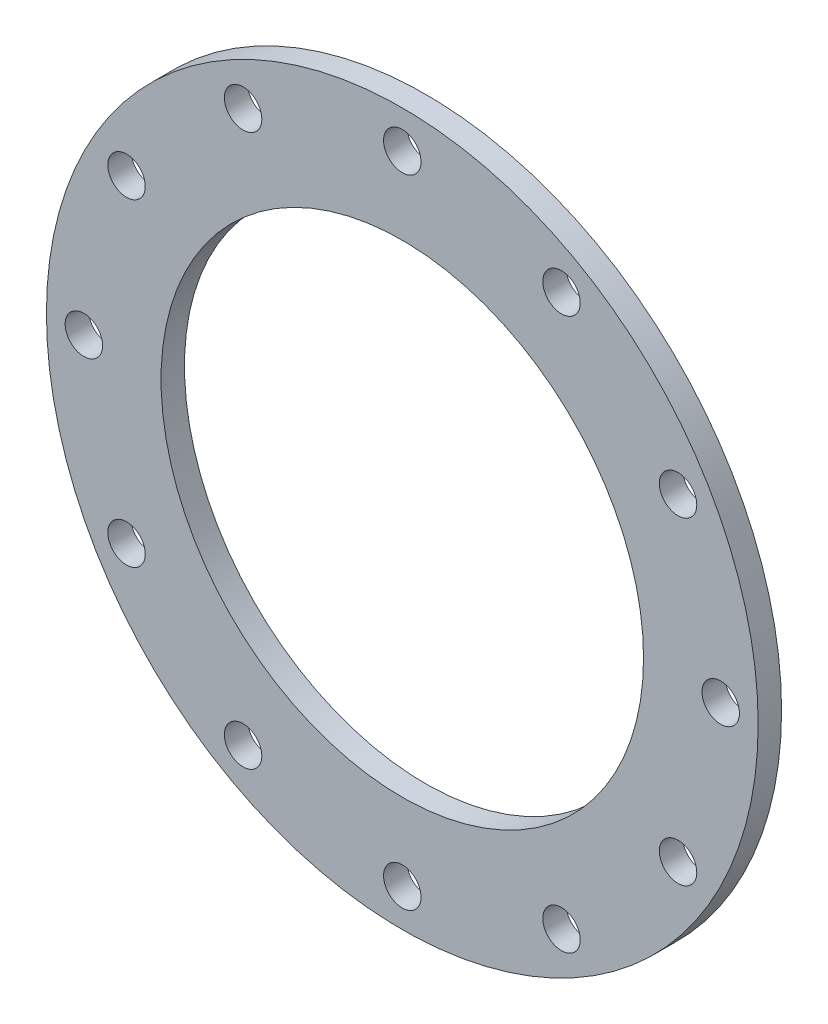
ISO-10303-21;
HEADER;
FILE_DESCRIPTION(('STEP AP214'),'2;1');
FILE_NAME('part.step','',(''),(''),'','','');
FILE_SCHEMA(('AUTOMOTIVE_DESIGN { 1 0 10303 214 1 1 1 1 }'));
ENDSEC;
DATA;
#1=APPLICATION_CONTEXT('core data for automotive mechanical design processes');
#2=APPLICATION_PROTOCOL_DEFINITION('international standard','automotive_design',2000,#1);
#3=PRODUCT_CONTEXT('',#1,'mechanical');
#4=PRODUCT('Part','Part','',(#3));
#5=PRODUCT_RELATED_PRODUCT_CATEGORY('part','',(#4));
#6=PRODUCT_DEFINITION_FORMATION('','',#4);
#7=PRODUCT_DEFINITION_CONTEXT('part definition',#1,'design');
#8=PRODUCT_DEFINITION('design','',#6,#7);
#9=PRODUCT_DEFINITION_SHAPE('','',#8);
#10=(LENGTH_UNIT() NAMED_UNIT(*) SI_UNIT(.MILLI.,.METRE.));
#11=(NAMED_UNIT(*) PLANE_ANGLE_UNIT() SI_UNIT($,.RADIAN.));
#12=(NAMED_UNIT(*) SI_UNIT($,.STERADIAN.) SOLID_ANGLE_UNIT());
#13=UNCERTAINTY_MEASURE_WITH_UNIT(LENGTH_MEASURE(1.E-05),#10,'distance_accuracy_value','');
#14=(GEOMETRIC_REPRESENTATION_CONTEXT(3) GLOBAL_UNCERTAINTY_ASSIGNED_CONTEXT((#13)) GLOBAL_UNIT_ASSIGNED_CONTEXT((#10,
#11,#12)) REPRESENTATION_CONTEXT('',''));
#15=CARTESIAN_POINT('',(0.,0.,0.));
#16=DIRECTION('',(0.,0.,1.));
#17=DIRECTION('',(1.,0.,0.));
#18=AXIS2_PLACEMENT_3D('',#15,#16,#17);
#19=CARTESIAN_POINT('',(0.,0.,7.9375));
#20=DIRECTION('',(0.,0.,1.));
#21=DIRECTION('',(1.,0.,0.));
#22=AXIS2_PLACEMENT_3D('',#19,#20,#21);
#23=PLANE('',#22);
#24=CARTESIAN_POINT('',(107.95,-186.974884677061,7.9375));
#25=DIRECTION('',(0.,0.,1.));
#26=DIRECTION('',(0.499999999999998,-0.86602540378444,0.));
#27=AXIS2_PLACEMENT_3D('',#24,#25,#26);
#28=CIRCLE('',#27,12.7);
#29=CARTESIAN_POINT('',(114.3,-197.973407305123,7.9375));
#30=VERTEX_POINT('',#29);
#31=EDGE_CURVE('E74',#30,#30,#28,.T.);
#32=ORIENTED_EDGE('',*,*,#31,.F.);
#33=EDGE_LOOP('',(#32));
#34=FACE_BOUND('',#33,.T.);
#35=CARTESIAN_POINT('',(-7.39933033248418E-13,-215.9,7.9375));
#36=DIRECTION('',(0.,0.,1.));
#37=DIRECTION('',(0.,-1.,0.));
#38=AXIS2_PLACEMENT_3D('',#35,#36,#37);
#39=CIRCLE('',#38,12.7);
#40=CARTESIAN_POINT('',(-7.84274846251726E-13,-228.6,7.9375));
#41=VERTEX_POINT('',#40);
#42=EDGE_CURVE('E113',#41,#41,#39,.T.);
#43=ORIENTED_EDGE('',*,*,#42,.F.);
#44=EDGE_LOOP('',(#43));
#45=FACE_BOUND('',#44,.T.);
#46=CARTESIAN_POINT('',(-107.950000000001,-186.97488467706,7.9375));
#47=DIRECTION('',(0.,0.,1.));
#48=DIRECTION('',(-0.500000000000004,-0.866025403784436,0.));
#49=AXIS2_PLACEMENT_3D('',#46,#47,#48);
#50=CIRCLE('',#49,12.7);
#51=CARTESIAN_POINT('',(-114.300000000001,-197.973407305122,7.9375));
#52=VERTEX_POINT('',#51);
#53=EDGE_CURVE('E107',#52,#52,#50,.T.);
#54=ORIENTED_EDGE('',*,*,#53,.F.);
#55=EDGE_LOOP('',(#54));
#56=FACE_BOUND('',#55,.T.);
#57=CARTESIAN_POINT('',(-186.974884677061,-107.949999999999,7.9375));
#58=DIRECTION('',(0.,0.,1.));
#59=DIRECTION('',(-0.866025403784442,-0.499999999999995,0.));
#60=AXIS2_PLACEMENT_3D('',#57,#58,#59);
#61=CIRCLE('',#60,12.7);
#62=CARTESIAN_POINT('',(-197.973407305123,-114.299999999999,7.9375));
#63=VERTEX_POINT('',#62);
#64=EDGE_CURVE('E101',#63,#63,#61,.T.);
#65=ORIENTED_EDGE('',*,*,#64,.F.);
#66=EDGE_LOOP('',(#65));
#67=FACE_BOUND('',#66,.T.);
#68=CARTESIAN_POINT('',(-215.9,0.,7.9375));
#69=DIRECTION('',(0.,0.,1.));
#70=DIRECTION('',(-1.,0.,0.));
#71=AXIS2_PLACEMENT_3D('',#68,#69,#70);
#72=CIRCLE('',#71,12.7);
#73=CARTESIAN_POINT('',(-228.6,0.,7.9375));
#74=VERTEX_POINT('',#73);
#75=EDGE_CURVE('E95',#74,#74,#72,.T.);
#76=ORIENTED_EDGE('',*,*,#75,.F.);
#77=EDGE_LOOP('',(#76));
#78=FACE_BOUND('',#77,.T.);
#79=CARTESIAN_POINT('',(-186.974884677059,107.950000000002,7.9375));
#80=DIRECTION('',(0.,0.,1.));
#81=DIRECTION('',(-0.866025403784435,0.500000000000007,0.));
#82=AXIS2_PLACEMENT_3D('',#79,#80,#81);
#83=CIRCLE('',#82,12.7);
#84=CARTESIAN_POINT('',(-197.973407305122,114.300000000002,7.9375));
#85=VERTEX_POINT('',#84);
#86=EDGE_CURVE('E89',#85,#85,#83,.T.);
#87=ORIENTED_EDGE('',*,*,#86,.F.);
#88=EDGE_LOOP('',(#87));
#89=FACE_BOUND('',#88,.T.);
#90=CARTESIAN_POINT('',(-107.949999999998,186.974884677061,7.9375));
#91=DIRECTION('',(0.,0.,1.));
#92=DIRECTION('',(-0.499999999999992,0.866025403784443,0.));
#93=AXIS2_PLACEMENT_3D('',#90,#91,#92);
#94=CIRCLE('',#93,12.7);
#95=CARTESIAN_POINT('',(-114.299999999998,197.973407305124,7.9375));
#96=VERTEX_POINT('',#95);
#97=EDGE_CURVE('E83',#96,#96,#94,.T.);
#98=ORIENTED_EDGE('',*,*,#97,.F.);
#99=EDGE_LOOP('',(#98));
#100=FACE_BOUND('',#99,.T.);
#101=CARTESIAN_POINT('',(2.24755467536088E-12,215.9,7.9375));
#102=DIRECTION('',(0.,0.,1.));
#103=DIRECTION('',(0.,1.,0.));
#104=AXIS2_PLACEMENT_3D('',#101,#102,#103);
#105=CIRCLE('',#104,12.7);
#106=CARTESIAN_POINT('',(2.38058011437081E-12,228.6,7.9375));
#107=VERTEX_POINT('',#106);
#108=EDGE_CURVE('E75',#107,#107,#105,.T.);
#109=ORIENTED_EDGE('',*,*,#108,.F.);
#110=EDGE_LOOP('',(#109));
#111=FACE_BOUND('',#110,.T.);
#112=CARTESIAN_POINT('',(107.950000000002,186.974884677059,7.9375));
#113=DIRECTION('',(0.,0.,1.));
#114=DIRECTION('',(0.50000000000001,0.866025403784433,0.));
#115=AXIS2_PLACEMENT_3D('',#112,#113,#114);
#116=CIRCLE('',#115,12.7);
#117=CARTESIAN_POINT('',(114.300000000002,197.973407305121,7.9375));
#118=VERTEX_POINT('',#117);
#119=EDGE_CURVE('E82',#118,#118,#116,.T.);
#120=ORIENTED_EDGE('',*,*,#119,.F.);
#121=EDGE_LOOP('',(#120));
#122=FACE_BOUND('',#121,.T.);
#123=CARTESIAN_POINT('',(186.974884677062,107.949999999998,7.9375));
#124=DIRECTION('',(0.,0.,1.));
#125=DIRECTION('',(0.866025403784445,0.499999999999989,0.));
#126=AXIS2_PLACEMENT_3D('',#123,#124,#125);
#127=CIRCLE('',#126,12.7);
#128=CARTESIAN_POINT('',(197.973407305124,114.299999999997,7.9375));
#129=VERTEX_POINT('',#128);
#130=EDGE_CURVE('E123',#129,#129,#127,.T.);
#131=ORIENTED_EDGE('',*,*,#130,.F.);
#132=EDGE_LOOP('',(#131));
#133=FACE_BOUND('',#132,.T.);
#134=CARTESIAN_POINT('',(186.97488467706,-107.95,7.9375));
#135=DIRECTION('',(0.,0.,1.));
#136=DIRECTION('',(0.866025403784438,-0.500000000000001,0.));
#137=AXIS2_PLACEMENT_3D('',#134,#135,#136);
#138=CIRCLE('',#137,12.7);
#139=CARTESIAN_POINT('',(197.973407305122,-114.3,7.9375));
#140=VERTEX_POINT('',#139);
#141=EDGE_CURVE('E68',#140,#140,#138,.T.);
#142=ORIENTED_EDGE('',*,*,#141,.F.);
#143=EDGE_LOOP('',(#142));
#144=FACE_BOUND('',#143,.T.);
#145=CARTESIAN_POINT('',(215.9,0.,7.9375));
#146=DIRECTION('',(0.,0.,1.));
#147=DIRECTION('',(1.,0.,0.));
#148=AXIS2_PLACEMENT_3D('',#145,#146,#147);
#149=CIRCLE('',#148,12.7);
#150=CARTESIAN_POINT('',(228.6,0.,7.9375));
#151=VERTEX_POINT('',#150);
#152=EDGE_CURVE('E65',#151,#151,#149,.T.);
#153=ORIENTED_EDGE('',*,*,#152,.F.);
#154=EDGE_LOOP('',(#153));
#155=FACE_BOUND('',#154,.T.);
#156=CARTESIAN_POINT('',(0.,0.,7.9375));
#157=DIRECTION('',(0.,0.,1.));
#158=DIRECTION('',(1.,0.,0.));
#159=AXIS2_PLACEMENT_3D('',#156,#157,#158);
#160=CIRCLE('',#159,241.3);
#161=CARTESIAN_POINT('',(241.3,0.,7.9375));
#162=VERTEX_POINT('',#161);
#163=EDGE_CURVE('E11',#162,#162,#160,.T.);
#164=ORIENTED_EDGE('',*,*,#163,.T.);
#165=EDGE_LOOP('',(#164));
#166=FACE_BOUND('',#165,.T.);
#167=CARTESIAN_POINT('',(0.,0.,7.9375));
#168=DIRECTION('',(0.,0.,1.));
#169=DIRECTION('',(1.,0.,0.));
#170=AXIS2_PLACEMENT_3D('',#167,#168,#169);
#171=CIRCLE('',#170,163.576);
#172=CARTESIAN_POINT('',(163.576,0.,7.9375));
#173=VERTEX_POINT('',#172);
#174=EDGE_CURVE('E55',#173,#173,#171,.T.);
#175=ORIENTED_EDGE('',*,*,#174,.F.);
#176=EDGE_LOOP('',(#175));
#177=FACE_BOUND('',#176,.T.);
#178=ADVANCED_FACE('F44',(#34,#45,#56,#67,#78,#89,#100,#111,#122,#133,#144,#155,#166,#177),#23,.T.);
#179=CARTESIAN_POINT('',(0.,0.,-7.9375));
#180=DIRECTION('',(0.,0.,1.));
#181=DIRECTION('',(1.,0.,0.));
#182=AXIS2_PLACEMENT_3D('',#179,#180,#181);
#183=PLANE('',#182);
#184=CARTESIAN_POINT('',(107.95,-186.974884677061,-7.9375));
#185=DIRECTION('',(0.,0.,1.));
#186=DIRECTION('',(0.499999999999998,-0.86602540378444,0.));
#187=AXIS2_PLACEMENT_3D('',#184,#185,#186);
#188=CIRCLE('',#187,12.7);
#189=CARTESIAN_POINT('',(114.3,-197.973407305123,-7.9375));
#190=VERTEX_POINT('',#189);
#191=EDGE_CURVE('E116',#190,#190,#188,.T.);
#192=ORIENTED_EDGE('',*,*,#191,.T.);
#193=EDGE_LOOP('',(#192));
#194=FACE_BOUND('',#193,.T.);
#195=CARTESIAN_POINT('',(-7.39933033248418E-13,-215.9,-7.9375));
#196=DIRECTION('',(0.,0.,1.));
#197=DIRECTION('',(0.,-1.,0.));
#198=AXIS2_PLACEMENT_3D('',#195,#196,#197);
#199=CIRCLE('',#198,12.7);
#200=CARTESIAN_POINT('',(-7.84274846251726E-13,-228.6,-7.9375));
#201=VERTEX_POINT('',#200);
#202=EDGE_CURVE('E110',#201,#201,#199,.T.);
#203=ORIENTED_EDGE('',*,*,#202,.T.);
#204=EDGE_LOOP('',(#203));
#205=FACE_BOUND('',#204,.T.);
#206=CARTESIAN_POINT('',(-107.950000000001,-186.97488467706,-7.9375));
#207=DIRECTION('',(0.,0.,1.));
#208=DIRECTION('',(-0.500000000000004,-0.866025403784436,0.));
#209=AXIS2_PLACEMENT_3D('',#206,#207,#208);
#210=CIRCLE('',#209,12.7);
#211=CARTESIAN_POINT('',(-114.300000000001,-197.973407305122,-7.9375));
#212=VERTEX_POINT('',#211);
#213=EDGE_CURVE('E104',#212,#212,#210,.T.);
#214=ORIENTED_EDGE('',*,*,#213,.T.);
#215=EDGE_LOOP('',(#214));
#216=FACE_BOUND('',#215,.T.);
#217=CARTESIAN_POINT('',(-186.974884677061,-107.949999999999,-7.9375));
#218=DIRECTION('',(0.,0.,1.));
#219=DIRECTION('',(-0.866025403784442,-0.499999999999995,0.));
#220=AXIS2_PLACEMENT_3D('',#217,#218,#219);
#221=CIRCLE('',#220,12.7);
#222=CARTESIAN_POINT('',(-197.973407305123,-114.299999999999,-7.9375));
#223=VERTEX_POINT('',#222);
#224=EDGE_CURVE('E98',#223,#223,#221,.T.);
#225=ORIENTED_EDGE('',*,*,#224,.T.);
#226=EDGE_LOOP('',(#225));
#227=FACE_BOUND('',#226,.T.);
#228=CARTESIAN_POINT('',(-215.9,0.,-7.9375));
#229=DIRECTION('',(0.,0.,1.));
#230=DIRECTION('',(-1.,0.,0.));
#231=AXIS2_PLACEMENT_3D('',#228,#229,#230);
#232=CIRCLE('',#231,12.7);
#233=CARTESIAN_POINT('',(-228.6,0.,-7.9375));
#234=VERTEX_POINT('',#233);
#235=EDGE_CURVE('E92',#234,#234,#232,.T.);
#236=ORIENTED_EDGE('',*,*,#235,.T.);
#237=EDGE_LOOP('',(#236));
#238=FACE_BOUND('',#237,.T.);
#239=CARTESIAN_POINT('',(-186.974884677059,107.950000000002,-7.9375));
#240=DIRECTION('',(0.,0.,1.));
#241=DIRECTION('',(-0.866025403784435,0.500000000000007,0.));
#242=AXIS2_PLACEMENT_3D('',#239,#240,#241);
#243=CIRCLE('',#242,12.7);
#244=CARTESIAN_POINT('',(-197.973407305122,114.300000000002,-7.9375));
#245=VERTEX_POINT('',#244);
#246=EDGE_CURVE('E86',#245,#245,#243,.T.);
#247=ORIENTED_EDGE('',*,*,#246,.T.);
#248=EDGE_LOOP('',(#247));
#249=FACE_BOUND('',#248,.T.);
#250=CARTESIAN_POINT('',(-107.949999999998,186.974884677061,-7.9375));
#251=DIRECTION('',(0.,0.,1.));
#252=DIRECTION('',(-0.499999999999992,0.866025403784443,0.));
#253=AXIS2_PLACEMENT_3D('',#250,#251,#252);
#254=CIRCLE('',#253,12.7);
#255=CARTESIAN_POINT('',(-114.299999999998,197.973407305124,-7.9375));
#256=VERTEX_POINT('',#255);
#257=EDGE_CURVE('E78',#256,#256,#254,.T.);
#258=ORIENTED_EDGE('',*,*,#257,.T.);
#259=EDGE_LOOP('',(#258));
#260=FACE_BOUND('',#259,.T.);
#261=CARTESIAN_POINT('',(2.24755467536088E-12,215.9,-7.9375));
#262=DIRECTION('',(0.,0.,1.));
#263=DIRECTION('',(0.,1.,0.));
#264=AXIS2_PLACEMENT_3D('',#261,#262,#263);
#265=CIRCLE('',#264,12.7);
#266=CARTESIAN_POINT('',(2.38058011437081E-12,228.6,-7.9375));
#267=VERTEX_POINT('',#266);
#268=EDGE_CURVE('E79',#267,#267,#265,.T.);
#269=ORIENTED_EDGE('',*,*,#268,.T.);
#270=EDGE_LOOP('',(#269));
#271=FACE_BOUND('',#270,.T.);
#272=CARTESIAN_POINT('',(107.950000000002,186.974884677059,-7.9375));
#273=DIRECTION('',(0.,0.,1.));
#274=DIRECTION('',(0.50000000000001,0.866025403784433,0.));
#275=AXIS2_PLACEMENT_3D('',#272,#273,#274);
#276=CIRCLE('',#275,12.7);
#277=CARTESIAN_POINT('',(114.300000000002,197.973407305121,-7.9375));
#278=VERTEX_POINT('',#277);
#279=EDGE_CURVE('E126',#278,#278,#276,.T.);
#280=ORIENTED_EDGE('',*,*,#279,.T.);
#281=EDGE_LOOP('',(#280));
#282=FACE_BOUND('',#281,.T.);
#283=CARTESIAN_POINT('',(186.974884677062,107.949999999998,-7.9375));
#284=DIRECTION('',(0.,0.,1.));
#285=DIRECTION('',(0.866025403784445,0.499999999999989,0.));
#286=AXIS2_PLACEMENT_3D('',#283,#284,#285);
#287=CIRCLE('',#286,12.7);
#288=CARTESIAN_POINT('',(197.973407305124,114.299999999997,-7.9375));
#289=VERTEX_POINT('',#288);
#290=EDGE_CURVE('E127',#289,#289,#287,.T.);
#291=ORIENTED_EDGE('',*,*,#290,.T.);
#292=EDGE_LOOP('',(#291));
#293=FACE_BOUND('',#292,.T.);
#294=CARTESIAN_POINT('',(186.97488467706,-107.95,-7.9375));
#295=DIRECTION('',(0.,0.,1.));
#296=DIRECTION('',(0.866025403784438,-0.500000000000001,0.));
#297=AXIS2_PLACEMENT_3D('',#294,#295,#296);
#298=CIRCLE('',#297,12.7);
#299=CARTESIAN_POINT('',(197.973407305122,-114.3,-7.9375));
#300=VERTEX_POINT('',#299);
#301=EDGE_CURVE('E71',#300,#300,#298,.T.);
#302=ORIENTED_EDGE('',*,*,#301,.T.);
#303=EDGE_LOOP('',(#302));
#304=FACE_BOUND('',#303,.T.);
#305=CARTESIAN_POINT('',(215.9,0.,-7.9375));
#306=DIRECTION('',(0.,0.,1.));
#307=DIRECTION('',(1.,0.,0.));
#308=AXIS2_PLACEMENT_3D('',#305,#306,#307);
#309=CIRCLE('',#308,12.7);
#310=CARTESIAN_POINT('',(228.6,0.,-7.9375));
#311=VERTEX_POINT('',#310);
#312=EDGE_CURVE('E60',#311,#311,#309,.T.);
#313=ORIENTED_EDGE('',*,*,#312,.T.);
#314=EDGE_LOOP('',(#313));
#315=FACE_BOUND('',#314,.T.);
#316=CARTESIAN_POINT('',(0.,0.,-7.9375));
#317=DIRECTION('',(0.,0.,1.));
#318=DIRECTION('',(1.,0.,0.));
#319=AXIS2_PLACEMENT_3D('',#316,#317,#318);
#320=CIRCLE('',#319,241.3);
#321=CARTESIAN_POINT('',(241.3,0.,-7.9375));
#322=VERTEX_POINT('',#321);
#323=EDGE_CURVE('E48',#322,#322,#320,.T.);
#324=ORIENTED_EDGE('',*,*,#323,.F.);
#325=EDGE_LOOP('',(#324));
#326=FACE_BOUND('',#325,.T.);
#327=CARTESIAN_POINT('',(0.,0.,-7.9375));
#328=DIRECTION('',(0.,0.,1.));
#329=DIRECTION('',(1.,0.,0.));
#330=AXIS2_PLACEMENT_3D('',#327,#328,#329);
#331=CIRCLE('',#330,163.576);
#332=CARTESIAN_POINT('',(163.576,0.,-7.9375));
#333=VERTEX_POINT('',#332);
#334=EDGE_CURVE('E57',#333,#333,#331,.T.);
#335=ORIENTED_EDGE('',*,*,#334,.T.);
#336=EDGE_LOOP('',(#335));
#337=FACE_BOUND('',#336,.T.);
#338=ADVANCED_FACE('F135',(#194,#205,#216,#227,#238,#249,#260,#271,#282,#293,#304,#315,#326,
#337),#183,.F.);
#339=CARTESIAN_POINT('',(0.,0.,7.9375));
#340=DIRECTION('',(0.,0.,-1.));
#341=DIRECTION('',(-1.,0.,0.));
#342=AXIS2_PLACEMENT_3D('',#339,#340,#341);
#343=CYLINDRICAL_SURFACE('',#342,241.3);
#344=ORIENTED_EDGE('',*,*,#163,.F.);
#345=EDGE_LOOP('',(#344));
#346=FACE_BOUND('',#345,.T.);
#347=ORIENTED_EDGE('',*,*,#323,.T.);
#348=EDGE_LOOP('',(#347));
#349=FACE_BOUND('',#348,.T.);
#350=ADVANCED_FACE('F46',(#346,#349),#343,.T.);
#351=CARTESIAN_POINT('',(0.,0.,7.9375));
#352=DIRECTION('',(0.,0.,-1.));
#353=DIRECTION('',(-1.,0.,0.));
#354=AXIS2_PLACEMENT_3D('',#351,#352,#353);
#355=CYLINDRICAL_SURFACE('',#354,163.576);
#356=ORIENTED_EDGE('',*,*,#174,.T.);
#357=EDGE_LOOP('',(#356));
#358=FACE_BOUND('',#357,.T.);
#359=ORIENTED_EDGE('',*,*,#334,.F.);
#360=EDGE_LOOP('',(#359));
#361=FACE_BOUND('',#360,.T.);
#362=ADVANCED_FACE('F158',(#358,#361),#355,.F.);
#363=CARTESIAN_POINT('',(215.9,0.,7.9375));
#364=DIRECTION('',(0.,0.,1.));
#365=DIRECTION('',(1.,0.,0.));
#366=AXIS2_PLACEMENT_3D('',#363,#364,#365);
#367=CYLINDRICAL_SURFACE('',#366,12.7);
#368=ORIENTED_EDGE('',*,*,#312,.F.);
#369=EDGE_LOOP('',(#368));
#370=FACE_BOUND('',#369,.T.);
#371=ORIENTED_EDGE('',*,*,#152,.T.);
#372=EDGE_LOOP('',(#371));
#373=FACE_BOUND('',#372,.T.);
#374=ADVANCED_FACE('F161',(#370,#373),#367,.F.);
#375=CARTESIAN_POINT('',(186.97488467706,-107.95,7.9375));
#376=DIRECTION('',(0.,0.,1.));
#377=DIRECTION('',(0.866025403784438,-0.500000000000001,0.));
#378=AXIS2_PLACEMENT_3D('',#375,#376,#377);
#379=CYLINDRICAL_SURFACE('',#378,12.7);
#380=ORIENTED_EDGE('',*,*,#301,.F.);
#381=EDGE_LOOP('',(#380));
#382=FACE_BOUND('',#381,.T.);
#383=ORIENTED_EDGE('',*,*,#141,.T.);
#384=EDGE_LOOP('',(#383));
#385=FACE_BOUND('',#384,.T.);
#386=ADVANCED_FACE('F175',(#382,#385),#379,.F.);
#387=CARTESIAN_POINT('',(186.974884677062,107.949999999998,7.9375));
#388=DIRECTION('',(0.,0.,1.));
#389=DIRECTION('',(0.866025403784445,0.499999999999989,0.));
#390=AXIS2_PLACEMENT_3D('',#387,#388,#389);
#391=CYLINDRICAL_SURFACE('',#390,12.7);
#392=ORIENTED_EDGE('',*,*,#290,.F.);
#393=EDGE_LOOP('',(#392));
#394=FACE_BOUND('',#393,.T.);
#395=ORIENTED_EDGE('',*,*,#130,.T.);
#396=EDGE_LOOP('',(#395));
#397=FACE_BOUND('',#396,.T.);
#398=ADVANCED_FACE('F142',(#394,#397),#391,.F.);
#399=CARTESIAN_POINT('',(107.950000000002,186.974884677059,7.9375));
#400=DIRECTION('',(0.,0.,1.));
#401=DIRECTION('',(0.50000000000001,0.866025403784433,0.));
#402=AXIS2_PLACEMENT_3D('',#399,#400,#401);
#403=CYLINDRICAL_SURFACE('',#402,12.7);
#404=ORIENTED_EDGE('',*,*,#279,.F.);
#405=EDGE_LOOP('',(#404));
#406=FACE_BOUND('',#405,.T.);
#407=ORIENTED_EDGE('',*,*,#119,.T.);
#408=EDGE_LOOP('',(#407));
#409=FACE_BOUND('',#408,.T.);
#410=ADVANCED_FACE('F138',(#406,#409),#403,.F.);
#411=CARTESIAN_POINT('',(2.24755467536088E-12,215.9,7.9375));
#412=DIRECTION('',(0.,0.,1.));
#413=DIRECTION('',(0.,1.,0.));
#414=AXIS2_PLACEMENT_3D('',#411,#412,#413);
#415=CYLINDRICAL_SURFACE('',#414,12.7);
#416=ORIENTED_EDGE('',*,*,#268,.F.);
#417=EDGE_LOOP('',(#416));
#418=FACE_BOUND('',#417,.T.);
#419=ORIENTED_EDGE('',*,*,#108,.T.);
#420=EDGE_LOOP('',(#419));
#421=FACE_BOUND('',#420,.T.);
#422=ADVANCED_FACE('F141',(#418,#421),#415,.F.);
#423=CARTESIAN_POINT('',(-107.949999999998,186.974884677061,7.9375));
#424=DIRECTION('',(0.,0.,1.));
#425=DIRECTION('',(-0.499999999999992,0.866025403784443,0.));
#426=AXIS2_PLACEMENT_3D('',#423,#424,#425);
#427=CYLINDRICAL_SURFACE('',#426,12.7);
#428=ORIENTED_EDGE('',*,*,#257,.F.);
#429=EDGE_LOOP('',(#428));
#430=FACE_BOUND('',#429,.T.);
#431=ORIENTED_EDGE('',*,*,#97,.T.);
#432=EDGE_LOOP('',(#431));
#433=FACE_BOUND('',#432,.T.);
#434=ADVANCED_FACE('F182',(#430,#433),#427,.F.);
#435=CARTESIAN_POINT('',(-186.974884677059,107.950000000002,7.9375));
#436=DIRECTION('',(0.,0.,1.));
#437=DIRECTION('',(-0.866025403784435,0.500000000000007,0.));
#438=AXIS2_PLACEMENT_3D('',#435,#436,#437);
#439=CYLINDRICAL_SURFACE('',#438,12.7);
#440=ORIENTED_EDGE('',*,*,#246,.F.);
#441=EDGE_LOOP('',(#440));
#442=FACE_BOUND('',#441,.T.);
#443=ORIENTED_EDGE('',*,*,#86,.T.);
#444=EDGE_LOOP('',(#443));
#445=FACE_BOUND('',#444,.T.);
#446=ADVANCED_FACE('F186',(#442,#445),#439,.F.);
#447=CARTESIAN_POINT('',(-215.9,0.,7.9375));
#448=DIRECTION('',(0.,0.,1.));
#449=DIRECTION('',(-1.,0.,0.));
#450=AXIS2_PLACEMENT_3D('',#447,#448,#449);
#451=CYLINDRICAL_SURFACE('',#450,12.7);
#452=ORIENTED_EDGE('',*,*,#235,.F.);
#453=EDGE_LOOP('',(#452));
#454=FACE_BOUND('',#453,.T.);
#455=ORIENTED_EDGE('',*,*,#75,.T.);
#456=EDGE_LOOP('',(#455));
#457=FACE_BOUND('',#456,.T.);
#458=ADVANCED_FACE('F190',(#454,#457),#451,.F.);
#459=CARTESIAN_POINT('',(-186.974884677061,-107.949999999999,7.9375));
#460=DIRECTION('',(0.,0.,1.));
#461=DIRECTION('',(-0.866025403784442,-0.499999999999995,0.));
#462=AXIS2_PLACEMENT_3D('',#459,#460,#461);
#463=CYLINDRICAL_SURFACE('',#462,12.7);
#464=ORIENTED_EDGE('',*,*,#224,.F.);
#465=EDGE_LOOP('',(#464));
#466=FACE_BOUND('',#465,.T.);
#467=ORIENTED_EDGE('',*,*,#64,.T.);
#468=EDGE_LOOP('',(#467));
#469=FACE_BOUND('',#468,.T.);
#470=ADVANCED_FACE('F194',(#466,#469),#463,.F.);
#471=CARTESIAN_POINT('',(-107.950000000001,-186.97488467706,7.9375));
#472=DIRECTION('',(0.,0.,1.));
#473=DIRECTION('',(-0.500000000000004,-0.866025403784436,0.));
#474=AXIS2_PLACEMENT_3D('',#471,#472,#473);
#475=CYLINDRICAL_SURFACE('',#474,12.7);
#476=ORIENTED_EDGE('',*,*,#213,.F.);
#477=EDGE_LOOP('',(#476));
#478=FACE_BOUND('',#477,.T.);
#479=ORIENTED_EDGE('',*,*,#53,.T.);
#480=EDGE_LOOP('',(#479));
#481=FACE_BOUND('',#480,.T.);
#482=ADVANCED_FACE('F198',(#478,#481),#475,.F.);
#483=CARTESIAN_POINT('',(-7.39933033248418E-13,-215.9,7.9375));
#484=DIRECTION('',(0.,0.,1.));
#485=DIRECTION('',(0.,-1.,0.));
#486=AXIS2_PLACEMENT_3D('',#483,#484,#485);
#487=CYLINDRICAL_SURFACE('',#486,12.7);
#488=ORIENTED_EDGE('',*,*,#202,.F.);
#489=EDGE_LOOP('',(#488));
#490=FACE_BOUND('',#489,.T.);
#491=ORIENTED_EDGE('',*,*,#42,.T.);
#492=EDGE_LOOP('',(#491));
#493=FACE_BOUND('',#492,.T.);
#494=ADVANCED_FACE('F202',(#490,#493),#487,.F.);
#495=CARTESIAN_POINT('',(107.95,-186.974884677061,7.9375));
#496=DIRECTION('',(0.,0.,1.));
#497=DIRECTION('',(0.499999999999998,-0.86602540378444,0.));
#498=AXIS2_PLACEMENT_3D('',#495,#496,#497);
#499=CYLINDRICAL_SURFACE('',#498,12.7);
#500=ORIENTED_EDGE('',*,*,#191,.F.);
#501=EDGE_LOOP('',(#500));
#502=FACE_BOUND('',#501,.T.);
#503=ORIENTED_EDGE('',*,*,#31,.T.);
#504=EDGE_LOOP('',(#503));
#505=FACE_BOUND('',#504,.T.);
#506=ADVANCED_FACE('F206',(#502,#505),#499,.F.);
#507=CLOSED_SHELL('',(#178,#338,#350,#362,#374,#386,#398,#410,#422,#434,#446,#458,#470,#482,
#494,#506));
#508=MANIFOLD_SOLID_BREP('B2',#507);
#509=ADVANCED_BREP_SHAPE_REPRESENTATION('',(#18,#508),#14);
#510=SHAPE_DEFINITION_REPRESENTATION(#9,#509);
ENDSEC;
END-ISO-10303-21;
